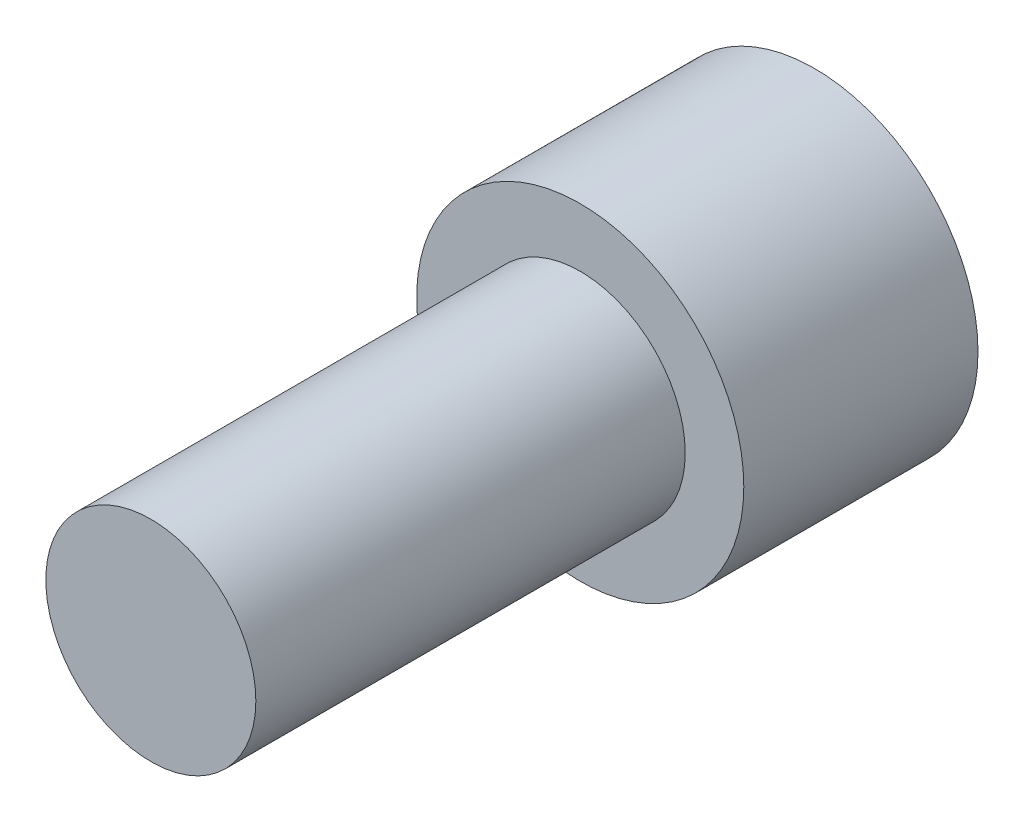
ISO-10303-21;
HEADER;
FILE_DESCRIPTION(('STEP AP214'),'2;1');
FILE_NAME('part.step','',(''),(''),'','','');
FILE_SCHEMA(('AUTOMOTIVE_DESIGN { 1 0 10303 214 1 1 1 1 }'));
ENDSEC;
DATA;
#1=APPLICATION_CONTEXT('core data for automotive mechanical design processes');
#2=APPLICATION_PROTOCOL_DEFINITION('international standard','automotive_design',2000,#1);
#3=PRODUCT_CONTEXT('',#1,'mechanical');
#4=PRODUCT('Part','Part','',(#3));
#5=PRODUCT_RELATED_PRODUCT_CATEGORY('part','',(#4));
#6=PRODUCT_DEFINITION_FORMATION('','',#4);
#7=PRODUCT_DEFINITION_CONTEXT('part definition',#1,'design');
#8=PRODUCT_DEFINITION('design','',#6,#7);
#9=PRODUCT_DEFINITION_SHAPE('','',#8);
#10=(LENGTH_UNIT() NAMED_UNIT(*) SI_UNIT(.MILLI.,.METRE.));
#11=(NAMED_UNIT(*) PLANE_ANGLE_UNIT() SI_UNIT($,.RADIAN.));
#12=(NAMED_UNIT(*) SI_UNIT($,.STERADIAN.) SOLID_ANGLE_UNIT());
#13=UNCERTAINTY_MEASURE_WITH_UNIT(LENGTH_MEASURE(1.E-05),#10,'distance_accuracy_value','');
#14=(GEOMETRIC_REPRESENTATION_CONTEXT(3) GLOBAL_UNCERTAINTY_ASSIGNED_CONTEXT((#13)) GLOBAL_UNIT_ASSIGNED_CONTEXT((#10,
#11,#12)) REPRESENTATION_CONTEXT('',''));
#15=CARTESIAN_POINT('',(0.,0.,0.));
#16=DIRECTION('',(0.,0.,1.));
#17=DIRECTION('',(1.,0.,0.));
#18=AXIS2_PLACEMENT_3D('',#15,#16,#17);
#19=CARTESIAN_POINT('',(0.,0.,6.));
#20=DIRECTION('',(0.,0.,-1.));
#21=DIRECTION('',(-1.,0.,0.));
#22=AXIS2_PLACEMENT_3D('',#19,#20,#21);
#23=CYLINDRICAL_SURFACE('',#22,4.191);
#24=CARTESIAN_POINT('',(0.,0.,6.));
#25=DIRECTION('',(0.,0.,1.));
#26=DIRECTION('',(1.,0.,0.));
#27=AXIS2_PLACEMENT_3D('',#24,#25,#26);
#28=CIRCLE('',#27,4.191);
#29=CARTESIAN_POINT('',(4.191,0.,6.));
#30=VERTEX_POINT('',#29);
#31=EDGE_CURVE('E38',#30,#30,#28,.T.);
#32=ORIENTED_EDGE('',*,*,#31,.F.);
#33=EDGE_LOOP('',(#32));
#34=FACE_BOUND('',#33,.T.);
#35=CARTESIAN_POINT('',(0.,0.,0.));
#36=DIRECTION('',(0.,0.,1.));
#37=DIRECTION('',(1.,0.,0.));
#38=AXIS2_PLACEMENT_3D('',#35,#36,#37);
#39=CIRCLE('',#38,4.191);
#40=CARTESIAN_POINT('',(4.191,0.,0.));
#41=VERTEX_POINT('',#40);
#42=EDGE_CURVE('E34',#41,#41,#39,.T.);
#43=ORIENTED_EDGE('',*,*,#42,.T.);
#44=EDGE_LOOP('',(#43));
#45=FACE_BOUND('',#44,.T.);
#46=ADVANCED_FACE('F31',(#34,#45),#23,.T.);
#47=CARTESIAN_POINT('',(0.,0.,6.));
#48=DIRECTION('',(0.,0.,1.));
#49=DIRECTION('',(1.,0.,0.));
#50=AXIS2_PLACEMENT_3D('',#47,#48,#49);
#51=PLANE('',#50);
#52=CARTESIAN_POINT('',(0.,0.,6.));
#53=DIRECTION('',(0.,0.,1.));
#54=DIRECTION('',(1.,0.,0.));
#55=AXIS2_PLACEMENT_3D('',#52,#53,#54);
#56=CIRCLE('',#55,2.69);
#57=CARTESIAN_POINT('',(2.69,0.,6.));
#58=VERTEX_POINT('',#57);
#59=EDGE_CURVE('E10',#58,#58,#56,.T.);
#60=ORIENTED_EDGE('',*,*,#59,.F.);
#61=EDGE_LOOP('',(#60));
#62=FACE_BOUND('',#61,.T.);
#63=ORIENTED_EDGE('',*,*,#31,.T.);
#64=EDGE_LOOP('',(#63));
#65=FACE_BOUND('',#64,.T.);
#66=ADVANCED_FACE('F55',(#62,#65),#51,.T.);
#67=CARTESIAN_POINT('',(0.,0.,0.));
#68=DIRECTION('',(0.,0.,1.));
#69=DIRECTION('',(1.,0.,0.));
#70=AXIS2_PLACEMENT_3D('',#67,#68,#69);
#71=PLANE('',#70);
#72=ORIENTED_EDGE('',*,*,#42,.F.);
#73=EDGE_LOOP('',(#72));
#74=FACE_BOUND('',#73,.T.);
#75=ADVANCED_FACE('F52',(#74),#71,.F.);
#76=CARTESIAN_POINT('',(0.,0.,17.));
#77=DIRECTION('',(0.,0.,-1.));
#78=DIRECTION('',(-1.,0.,0.));
#79=AXIS2_PLACEMENT_3D('',#76,#77,#78);
#80=CYLINDRICAL_SURFACE('',#79,2.69);
#81=CARTESIAN_POINT('',(0.,0.,17.));
#82=DIRECTION('',(0.,0.,1.));
#83=DIRECTION('',(1.,0.,0.));
#84=AXIS2_PLACEMENT_3D('',#81,#82,#83);
#85=CIRCLE('',#84,2.69);
#86=CARTESIAN_POINT('',(2.69,0.,17.));
#87=VERTEX_POINT('',#86);
#88=EDGE_CURVE('E44',#87,#87,#85,.T.);
#89=ORIENTED_EDGE('',*,*,#88,.F.);
#90=EDGE_LOOP('',(#89));
#91=FACE_BOUND('',#90,.T.);
#92=ORIENTED_EDGE('',*,*,#59,.T.);
#93=EDGE_LOOP('',(#92));
#94=FACE_BOUND('',#93,.T.);
#95=ADVANCED_FACE('F54',(#91,#94),#80,.T.);
#96=CARTESIAN_POINT('',(0.,0.,17.));
#97=DIRECTION('',(0.,0.,1.));
#98=DIRECTION('',(1.,0.,0.));
#99=AXIS2_PLACEMENT_3D('',#96,#97,#98);
#100=PLANE('',#99);
#101=ORIENTED_EDGE('',*,*,#88,.T.);
#102=EDGE_LOOP('',(#101));
#103=FACE_BOUND('',#102,.T.);
#104=ADVANCED_FACE('F60',(#103),#100,.T.);
#105=CLOSED_SHELL('',(#46,#66,#75,#95,#104));
#106=MANIFOLD_SOLID_BREP('B2',#105);
#107=ADVANCED_BREP_SHAPE_REPRESENTATION('',(#18,#106),#14);
#108=SHAPE_DEFINITION_REPRESENTATION(#9,#107);
ENDSEC;
END-ISO-10303-21;
